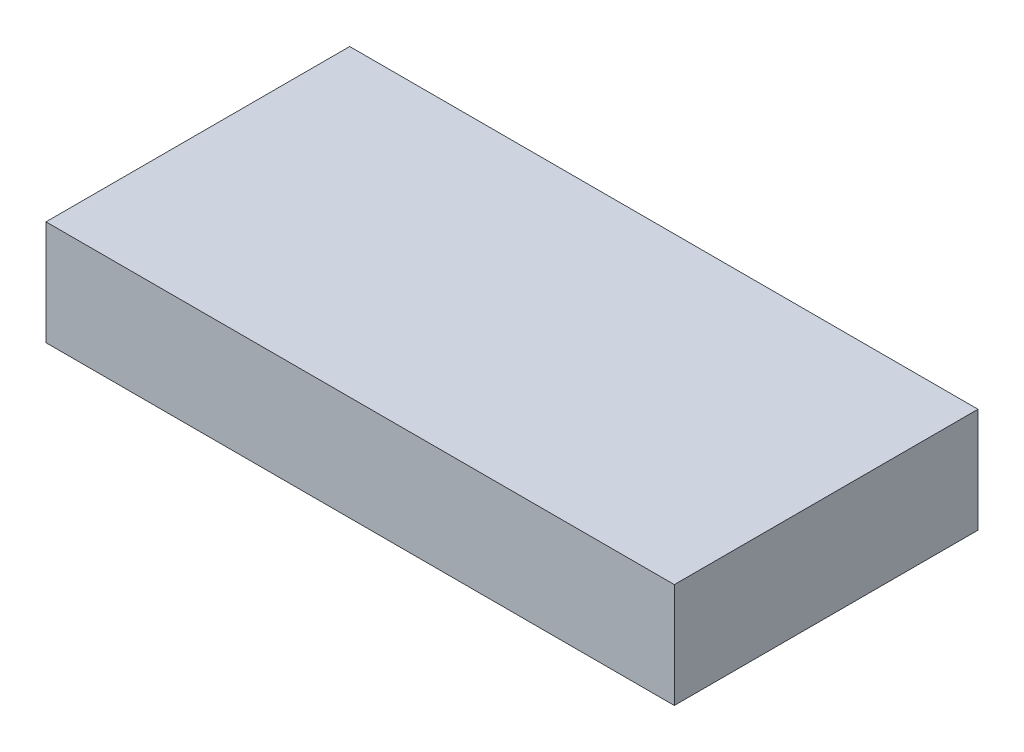
ISO-10303-21;
HEADER;
FILE_DESCRIPTION(('STEP AP214'),'2;1');
FILE_NAME('part.step','',(''),(''),'','','');
FILE_SCHEMA(('AUTOMOTIVE_DESIGN { 1 0 10303 214 1 1 1 1 }'));
ENDSEC;
DATA;
#1=APPLICATION_CONTEXT('core data for automotive mechanical design processes');
#2=APPLICATION_PROTOCOL_DEFINITION('international standard','automotive_design',2000,#1);
#3=PRODUCT_CONTEXT('',#1,'mechanical');
#4=PRODUCT('Part','Part','',(#3));
#5=PRODUCT_RELATED_PRODUCT_CATEGORY('part','',(#4));
#6=PRODUCT_DEFINITION_FORMATION('','',#4);
#7=PRODUCT_DEFINITION_CONTEXT('part definition',#1,'design');
#8=PRODUCT_DEFINITION('design','',#6,#7);
#9=PRODUCT_DEFINITION_SHAPE('','',#8);
#10=(LENGTH_UNIT() NAMED_UNIT(*) SI_UNIT(.MILLI.,.METRE.));
#11=(NAMED_UNIT(*) PLANE_ANGLE_UNIT() SI_UNIT($,.RADIAN.));
#12=(NAMED_UNIT(*) SI_UNIT($,.STERADIAN.) SOLID_ANGLE_UNIT());
#13=UNCERTAINTY_MEASURE_WITH_UNIT(LENGTH_MEASURE(1.E-05),#10,'distance_accuracy_value','');
#14=(GEOMETRIC_REPRESENTATION_CONTEXT(3) GLOBAL_UNCERTAINTY_ASSIGNED_CONTEXT((#13)) GLOBAL_UNIT_ASSIGNED_CONTEXT((#10,
#11,#12)) REPRESENTATION_CONTEXT('',''));
#15=CARTESIAN_POINT('',(0.,0.,0.));
#16=DIRECTION('',(0.,0.,1.));
#17=DIRECTION('',(1.,0.,0.));
#18=AXIS2_PLACEMENT_3D('',#15,#16,#17);
#19=CARTESIAN_POINT('',(0.,5.,0.));
#20=DIRECTION('',(1.,0.,0.));
#21=DIRECTION('',(0.,0.,-1.));
#22=AXIS2_PLACEMENT_3D('',#19,#20,#21);
#23=PLANE('',#22);
#24=DIRECTION('',(0.,0.,1.));
#25=VECTOR('',#24,1.);
#26=CARTESIAN_POINT('',(0.,0.,0.));
#27=LINE('',#26,#25);
#28=CARTESIAN_POINT('',(0.,0.,-14.5));
#29=VERTEX_POINT('',#28);
#30=CARTESIAN_POINT('',(0.,0.,0.));
#31=VERTEX_POINT('',#30);
#32=EDGE_CURVE('E101',#29,#31,#27,.T.);
#33=ORIENTED_EDGE('',*,*,#32,.T.);
#34=DIRECTION('',(0.,-1.,0.));
#35=VECTOR('',#34,1.);
#36=CARTESIAN_POINT('',(0.,5.,0.));
#37=LINE('',#36,#35);
#38=CARTESIAN_POINT('',(0.,5.,0.));
#39=VERTEX_POINT('',#38);
#40=EDGE_CURVE('E11',#39,#31,#37,.T.);
#41=ORIENTED_EDGE('',*,*,#40,.F.);
#42=DIRECTION('',(0.,0.,1.));
#43=VECTOR('',#42,1.);
#44=CARTESIAN_POINT('',(0.,5.,0.));
#45=LINE('',#44,#43);
#46=CARTESIAN_POINT('',(0.,5.,-14.5));
#47=VERTEX_POINT('',#46);
#48=EDGE_CURVE('E89',#47,#39,#45,.T.);
#49=ORIENTED_EDGE('',*,*,#48,.F.);
#50=DIRECTION('',(0.,-1.,0.));
#51=VECTOR('',#50,1.);
#52=CARTESIAN_POINT('',(0.,5.,-14.5));
#53=LINE('',#52,#51);
#54=EDGE_CURVE('E97',#47,#29,#53,.T.);
#55=ORIENTED_EDGE('',*,*,#54,.T.);
#56=EDGE_LOOP('',(#33,#41,#49,#55));
#57=FACE_BOUND('',#56,.T.);
#58=ADVANCED_FACE('F38',(#57),#23,.F.);
#59=CARTESIAN_POINT('',(0.,5.,0.));
#60=DIRECTION('',(0.,0.,-1.));
#61=DIRECTION('',(-1.,0.,0.));
#62=AXIS2_PLACEMENT_3D('',#59,#60,#61);
#63=PLANE('',#62);
#64=DIRECTION('',(1.,0.,0.));
#65=VECTOR('',#64,1.);
#66=CARTESIAN_POINT('',(0.,0.,0.));
#67=LINE('',#66,#65);
#68=CARTESIAN_POINT('',(30.,0.,0.));
#69=VERTEX_POINT('',#68);
#70=EDGE_CURVE('E93',#31,#69,#67,.T.);
#71=ORIENTED_EDGE('',*,*,#70,.T.);
#72=DIRECTION('',(0.,-1.,0.));
#73=VECTOR('',#72,1.);
#74=CARTESIAN_POINT('',(30.,5.,0.));
#75=LINE('',#74,#73);
#76=CARTESIAN_POINT('',(30.,5.,0.));
#77=VERTEX_POINT('',#76);
#78=EDGE_CURVE('E46',#77,#69,#75,.T.);
#79=ORIENTED_EDGE('',*,*,#78,.F.);
#80=DIRECTION('',(1.,0.,0.));
#81=VECTOR('',#80,1.);
#82=CARTESIAN_POINT('',(0.,5.,0.));
#83=LINE('',#82,#81);
#84=EDGE_CURVE('E84',#39,#77,#83,.T.);
#85=ORIENTED_EDGE('',*,*,#84,.F.);
#86=ORIENTED_EDGE('',*,*,#40,.T.);
#87=EDGE_LOOP('',(#71,#79,#85,#86));
#88=FACE_BOUND('',#87,.T.);
#89=ADVANCED_FACE('F92',(#88),#63,.F.);
#90=CARTESIAN_POINT('',(30.,5.,0.));
#91=DIRECTION('',(-1.,0.,0.));
#92=DIRECTION('',(0.,0.,1.));
#93=AXIS2_PLACEMENT_3D('',#90,#91,#92);
#94=PLANE('',#93);
#95=DIRECTION('',(0.,0.,-1.));
#96=VECTOR('',#95,1.);
#97=CARTESIAN_POINT('',(30.,0.,0.));
#98=LINE('',#97,#96);
#99=CARTESIAN_POINT('',(30.,0.,-14.5));
#100=VERTEX_POINT('',#99);
#101=EDGE_CURVE('E71',#69,#100,#98,.T.);
#102=ORIENTED_EDGE('',*,*,#101,.T.);
#103=DIRECTION('',(0.,-1.,0.));
#104=VECTOR('',#103,1.);
#105=CARTESIAN_POINT('',(30.,5.,-14.5));
#106=LINE('',#105,#104);
#107=CARTESIAN_POINT('',(30.,5.,-14.5));
#108=VERTEX_POINT('',#107);
#109=EDGE_CURVE('E94',#108,#100,#106,.T.);
#110=ORIENTED_EDGE('',*,*,#109,.F.);
#111=DIRECTION('',(0.,0.,-1.));
#112=VECTOR('',#111,1.);
#113=CARTESIAN_POINT('',(30.,5.,0.));
#114=LINE('',#113,#112);
#115=EDGE_CURVE('E87',#77,#108,#114,.T.);
#116=ORIENTED_EDGE('',*,*,#115,.F.);
#117=ORIENTED_EDGE('',*,*,#78,.T.);
#118=EDGE_LOOP('',(#102,#110,#116,#117));
#119=FACE_BOUND('',#118,.T.);
#120=ADVANCED_FACE('F95',(#119),#94,.F.);
#121=CARTESIAN_POINT('',(0.,5.,-14.5));
#122=DIRECTION('',(0.,0.,1.));
#123=DIRECTION('',(1.,0.,0.));
#124=AXIS2_PLACEMENT_3D('',#121,#122,#123);
#125=PLANE('',#124);
#126=DIRECTION('',(-1.,0.,0.));
#127=VECTOR('',#126,1.);
#128=CARTESIAN_POINT('',(0.,0.,-14.5));
#129=LINE('',#128,#127);
#130=EDGE_CURVE('E77',#100,#29,#129,.T.);
#131=ORIENTED_EDGE('',*,*,#130,.T.);
#132=ORIENTED_EDGE('',*,*,#54,.F.);
#133=DIRECTION('',(-1.,0.,0.));
#134=VECTOR('',#133,1.);
#135=CARTESIAN_POINT('',(0.,5.,-14.5));
#136=LINE('',#135,#134);
#137=EDGE_CURVE('E54',#108,#47,#136,.T.);
#138=ORIENTED_EDGE('',*,*,#137,.F.);
#139=ORIENTED_EDGE('',*,*,#109,.T.);
#140=EDGE_LOOP('',(#131,#132,#138,#139));
#141=FACE_BOUND('',#140,.T.);
#142=ADVANCED_FACE('F108',(#141),#125,.F.);
#143=CARTESIAN_POINT('',(0.,5.,0.));
#144=DIRECTION('',(0.,-1.,0.));
#145=DIRECTION('',(0.,0.,-1.));
#146=AXIS2_PLACEMENT_3D('',#143,#144,#145);
#147=PLANE('',#146);
#148=ORIENTED_EDGE('',*,*,#48,.T.);
#149=ORIENTED_EDGE('',*,*,#84,.T.);
#150=ORIENTED_EDGE('',*,*,#115,.T.);
#151=ORIENTED_EDGE('',*,*,#137,.T.);
#152=EDGE_LOOP('',(#148,#149,#150,#151));
#153=FACE_BOUND('',#152,.T.);
#154=ADVANCED_FACE('F85',(#153),#147,.F.);
#155=CARTESIAN_POINT('',(0.,0.,0.));
#156=DIRECTION('',(0.,-1.,0.));
#157=DIRECTION('',(0.,0.,-1.));
#158=AXIS2_PLACEMENT_3D('',#155,#156,#157);
#159=PLANE('',#158);
#160=ORIENTED_EDGE('',*,*,#32,.F.);
#161=ORIENTED_EDGE('',*,*,#130,.F.);
#162=ORIENTED_EDGE('',*,*,#101,.F.);
#163=ORIENTED_EDGE('',*,*,#70,.F.);
#164=EDGE_LOOP('',(#160,#161,#162,#163));
#165=FACE_BOUND('',#164,.T.);
#166=ADVANCED_FACE('F111',(#165),#159,.T.);
#167=CLOSED_SHELL('',(#58,#89,#120,#142,#154,#166));
#168=MANIFOLD_SOLID_BREP('B2',#167);
#169=ADVANCED_BREP_SHAPE_REPRESENTATION('',(#18,#168),#14);
#170=SHAPE_DEFINITION_REPRESENTATION(#9,#169);
ENDSEC;
END-ISO-10303-21;
